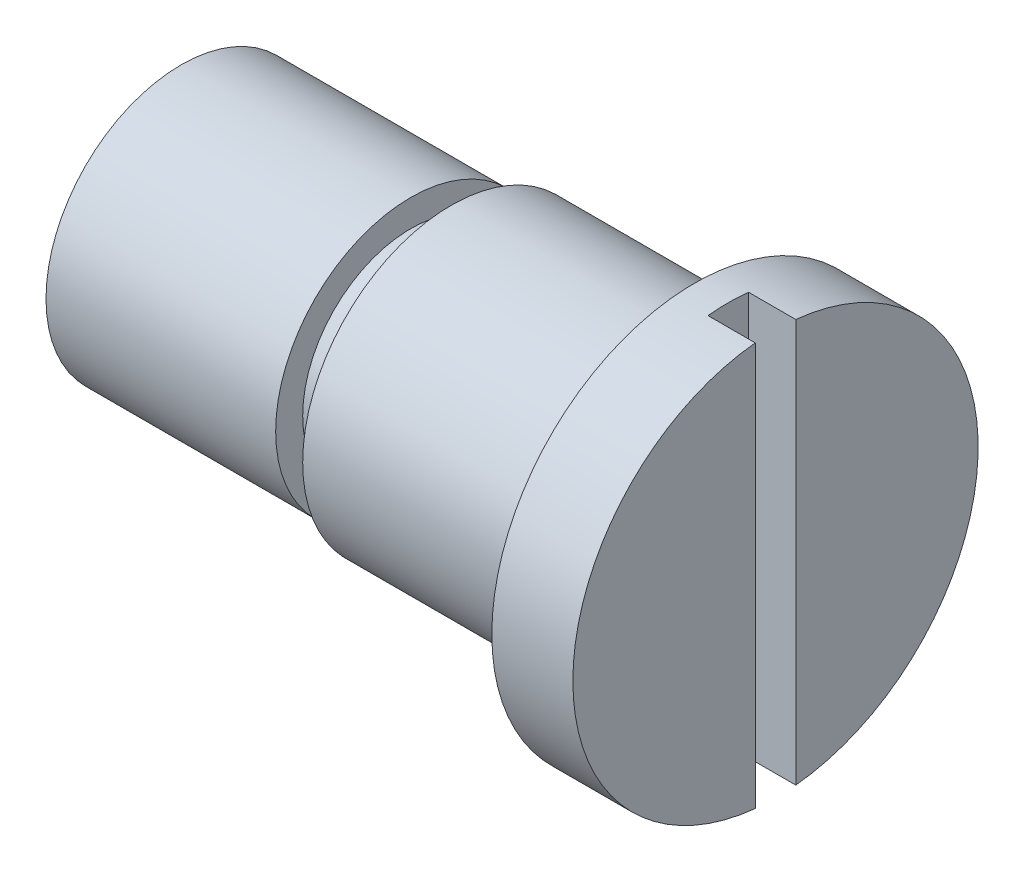
ISO-10303-21;
HEADER;
FILE_DESCRIPTION(('STEP AP214'),'2;1');
FILE_NAME('part.step','',(''),(''),'','','');
FILE_SCHEMA(('AUTOMOTIVE_DESIGN { 1 0 10303 214 1 1 1 1 }'));
ENDSEC;
DATA;
#1=APPLICATION_CONTEXT('core data for automotive mechanical design processes');
#2=APPLICATION_PROTOCOL_DEFINITION('international standard','automotive_design',2000,#1);
#3=PRODUCT_CONTEXT('',#1,'mechanical');
#4=PRODUCT('Part','Part','',(#3));
#5=PRODUCT_RELATED_PRODUCT_CATEGORY('part','',(#4));
#6=PRODUCT_DEFINITION_FORMATION('','',#4);
#7=PRODUCT_DEFINITION_CONTEXT('part definition',#1,'design');
#8=PRODUCT_DEFINITION('design','',#6,#7);
#9=PRODUCT_DEFINITION_SHAPE('','',#8);
#10=(LENGTH_UNIT() NAMED_UNIT(*) SI_UNIT(.MILLI.,.METRE.));
#11=(NAMED_UNIT(*) PLANE_ANGLE_UNIT() SI_UNIT($,.RADIAN.));
#12=(NAMED_UNIT(*) SI_UNIT($,.STERADIAN.) SOLID_ANGLE_UNIT());
#13=UNCERTAINTY_MEASURE_WITH_UNIT(LENGTH_MEASURE(1.E-05),#10,'distance_accuracy_value','');
#14=(GEOMETRIC_REPRESENTATION_CONTEXT(3) GLOBAL_UNCERTAINTY_ASSIGNED_CONTEXT((#13)) GLOBAL_UNIT_ASSIGNED_CONTEXT((#10,
#11,#12)) REPRESENTATION_CONTEXT('',''));
#15=CARTESIAN_POINT('',(0.,0.,0.));
#16=DIRECTION('',(0.,0.,1.));
#17=DIRECTION('',(1.,0.,0.));
#18=AXIS2_PLACEMENT_3D('',#15,#16,#17);
#19=CARTESIAN_POINT('',(44.,15.,0.));
#20=DIRECTION('',(-1.,0.,0.));
#21=DIRECTION('',(0.,0.,1.));
#22=AXIS2_PLACEMENT_3D('',#19,#20,#21);
#23=PLANE('',#22);
#24=CARTESIAN_POINT('',(44.,0.,0.));
#25=DIRECTION('',(-1.,0.,0.));
#26=DIRECTION('',(0.,0.,1.));
#27=AXIS2_PLACEMENT_3D('',#24,#25,#26);
#28=CIRCLE('',#27,15.);
#29=CARTESIAN_POINT('',(44.,14.9248115565993,-1.5));
#30=VERTEX_POINT('',#29);
#31=CARTESIAN_POINT('',(44.,-14.9248115565993,-1.5));
#32=VERTEX_POINT('',#31);
#33=EDGE_CURVE('E97',#30,#32,#28,.T.);
#34=ORIENTED_EDGE('',*,*,#33,.F.);
#35=DIRECTION('',(0.,-1.,0.));
#36=VECTOR('',#35,1.);
#37=CARTESIAN_POINT('',(44.,15.,-1.5));
#38=LINE('',#37,#36);
#39=EDGE_CURVE('E84',#30,#32,#38,.T.);
#40=ORIENTED_EDGE('',*,*,#39,.T.);
#41=EDGE_LOOP('',(#34,#40));
#42=FACE_BOUND('',#41,.T.);
#43=ADVANCED_FACE('F37',(#42),#23,.F.);
#44=CARTESIAN_POINT('',(0.,0.,0.));
#45=DIRECTION('',(1.,0.,0.));
#46=DIRECTION('',(0.,0.,-1.));
#47=AXIS2_PLACEMENT_3D('',#44,#45,#46);
#48=PLANE('',#47);
#49=CARTESIAN_POINT('',(0.,0.,0.));
#50=DIRECTION('',(-1.,0.,0.));
#51=DIRECTION('',(0.,0.,1.));
#52=AXIS2_PLACEMENT_3D('',#49,#50,#51);
#53=CIRCLE('',#52,10.);
#54=CARTESIAN_POINT('',(0.,0.,10.));
#55=VERTEX_POINT('',#54);
#56=EDGE_CURVE('E85',#55,#55,#53,.T.);
#57=ORIENTED_EDGE('',*,*,#56,.T.);
#58=EDGE_LOOP('',(#57));
#59=FACE_BOUND('',#58,.T.);
#60=ADVANCED_FACE('F39',(#59),#48,.F.);
#61=CARTESIAN_POINT('',(0.,0.,0.));
#62=DIRECTION('',(-1.,0.,0.));
#63=DIRECTION('',(0.,0.,1.));
#64=AXIS2_PLACEMENT_3D('',#61,#62,#63);
#65=CYLINDRICAL_SURFACE('',#64,10.);
#66=ORIENTED_EDGE('',*,*,#56,.F.);
#67=EDGE_LOOP('',(#66));
#68=FACE_BOUND('',#67,.T.);
#69=CARTESIAN_POINT('',(17.,0.,0.));
#70=DIRECTION('',(-1.,0.,0.));
#71=DIRECTION('',(0.,0.,1.));
#72=AXIS2_PLACEMENT_3D('',#69,#70,#71);
#73=CIRCLE('',#72,10.);
#74=CARTESIAN_POINT('',(17.,0.,10.));
#75=VERTEX_POINT('',#74);
#76=EDGE_CURVE('E119',#75,#75,#73,.T.);
#77=ORIENTED_EDGE('',*,*,#76,.T.);
#78=EDGE_LOOP('',(#77));
#79=FACE_BOUND('',#78,.T.);
#80=ADVANCED_FACE('F136',(#68,#79),#65,.T.);
#81=CARTESIAN_POINT('',(17.,10.,0.));
#82=DIRECTION('',(-1.,0.,0.));
#83=DIRECTION('',(0.,0.,1.));
#84=AXIS2_PLACEMENT_3D('',#81,#82,#83);
#85=PLANE('',#84);
#86=ORIENTED_EDGE('',*,*,#76,.F.);
#87=EDGE_LOOP('',(#86));
#88=FACE_BOUND('',#87,.T.);
#89=CARTESIAN_POINT('',(17.,0.,0.));
#90=DIRECTION('',(-1.,0.,0.));
#91=DIRECTION('',(0.,0.,1.));
#92=AXIS2_PLACEMENT_3D('',#89,#90,#91);
#93=CIRCLE('',#92,8.);
#94=CARTESIAN_POINT('',(17.,0.,8.));
#95=VERTEX_POINT('',#94);
#96=EDGE_CURVE('E116',#95,#95,#93,.T.);
#97=ORIENTED_EDGE('',*,*,#96,.T.);
#98=EDGE_LOOP('',(#97));
#99=FACE_BOUND('',#98,.T.);
#100=ADVANCED_FACE('F164',(#88,#99),#85,.F.);
#101=CARTESIAN_POINT('',(0.,0.,0.));
#102=DIRECTION('',(-1.,0.,0.));
#103=DIRECTION('',(0.,0.,1.));
#104=AXIS2_PLACEMENT_3D('',#101,#102,#103);
#105=CYLINDRICAL_SURFACE('',#104,8.);
#106=ORIENTED_EDGE('',*,*,#96,.F.);
#107=EDGE_LOOP('',(#106));
#108=FACE_BOUND('',#107,.T.);
#109=CARTESIAN_POINT('',(20.,0.,0.));
#110=DIRECTION('',(-1.,0.,0.));
#111=DIRECTION('',(0.,0.,1.));
#112=AXIS2_PLACEMENT_3D('',#109,#110,#111);
#113=CIRCLE('',#112,8.);
#114=CARTESIAN_POINT('',(20.,0.,8.));
#115=VERTEX_POINT('',#114);
#116=EDGE_CURVE('E113',#115,#115,#113,.T.);
#117=ORIENTED_EDGE('',*,*,#116,.T.);
#118=EDGE_LOOP('',(#117));
#119=FACE_BOUND('',#118,.T.);
#120=ADVANCED_FACE('F160',(#108,#119),#105,.T.);
#121=CARTESIAN_POINT('',(20.,8.,0.));
#122=DIRECTION('',(1.,0.,0.));
#123=DIRECTION('',(0.,0.,-1.));
#124=AXIS2_PLACEMENT_3D('',#121,#122,#123);
#125=PLANE('',#124);
#126=ORIENTED_EDGE('',*,*,#116,.F.);
#127=EDGE_LOOP('',(#126));
#128=FACE_BOUND('',#127,.T.);
#129=CARTESIAN_POINT('',(20.,0.,0.));
#130=DIRECTION('',(-1.,0.,0.));
#131=DIRECTION('',(0.,0.,1.));
#132=AXIS2_PLACEMENT_3D('',#129,#130,#131);
#133=CIRCLE('',#132,11.);
#134=CARTESIAN_POINT('',(20.,0.,11.));
#135=VERTEX_POINT('',#134);
#136=EDGE_CURVE('E110',#135,#135,#133,.T.);
#137=ORIENTED_EDGE('',*,*,#136,.T.);
#138=EDGE_LOOP('',(#137));
#139=FACE_BOUND('',#138,.T.);
#140=ADVANCED_FACE('F156',(#128,#139),#125,.F.);
#141=CARTESIAN_POINT('',(0.,0.,0.));
#142=DIRECTION('',(-1.,0.,0.));
#143=DIRECTION('',(0.,0.,1.));
#144=AXIS2_PLACEMENT_3D('',#141,#142,#143);
#145=CYLINDRICAL_SURFACE('',#144,11.);
#146=ORIENTED_EDGE('',*,*,#136,.F.);
#147=EDGE_LOOP('',(#146));
#148=FACE_BOUND('',#147,.T.);
#149=CARTESIAN_POINT('',(38.,0.,0.));
#150=DIRECTION('',(-1.,0.,0.));
#151=DIRECTION('',(0.,0.,1.));
#152=AXIS2_PLACEMENT_3D('',#149,#150,#151);
#153=CIRCLE('',#152,11.);
#154=CARTESIAN_POINT('',(38.,0.,11.));
#155=VERTEX_POINT('',#154);
#156=EDGE_CURVE('E107',#155,#155,#153,.T.);
#157=ORIENTED_EDGE('',*,*,#156,.T.);
#158=EDGE_LOOP('',(#157));
#159=FACE_BOUND('',#158,.T.);
#160=ADVANCED_FACE('F150',(#148,#159),#145,.T.);
#161=CARTESIAN_POINT('',(38.,11.,0.));
#162=DIRECTION('',(1.,0.,0.));
#163=DIRECTION('',(0.,0.,-1.));
#164=AXIS2_PLACEMENT_3D('',#161,#162,#163);
#165=PLANE('',#164);
#166=ORIENTED_EDGE('',*,*,#156,.F.);
#167=EDGE_LOOP('',(#166));
#168=FACE_BOUND('',#167,.T.);
#169=CARTESIAN_POINT('',(38.,0.,0.));
#170=DIRECTION('',(-1.,0.,0.));
#171=DIRECTION('',(0.,0.,1.));
#172=AXIS2_PLACEMENT_3D('',#169,#170,#171);
#173=CIRCLE('',#172,15.);
#174=CARTESIAN_POINT('',(38.,0.,15.));
#175=VERTEX_POINT('',#174);
#176=EDGE_CURVE('E101',#175,#175,#173,.T.);
#177=ORIENTED_EDGE('',*,*,#176,.T.);
#178=EDGE_LOOP('',(#177));
#179=FACE_BOUND('',#178,.T.);
#180=ADVANCED_FACE('F146',(#168,#179),#165,.F.);
#181=CARTESIAN_POINT('',(0.,0.,0.));
#182=DIRECTION('',(-1.,0.,0.));
#183=DIRECTION('',(0.,0.,1.));
#184=AXIS2_PLACEMENT_3D('',#181,#182,#183);
#185=CYLINDRICAL_SURFACE('',#184,15.);
#186=CARTESIAN_POINT('',(40.5,0.,0.));
#187=DIRECTION('',(1.,0.,0.));
#188=DIRECTION('',(0.,0.,-1.));
#189=AXIS2_PLACEMENT_3D('',#186,#187,#188);
#190=CIRCLE('',#189,15.);
#191=CARTESIAN_POINT('',(40.5,14.9248115565993,-1.5));
#192=VERTEX_POINT('',#191);
#193=CARTESIAN_POINT('',(40.5,14.9248115565993,1.5));
#194=VERTEX_POINT('',#193);
#195=EDGE_CURVE('E11',#192,#194,#190,.T.);
#196=ORIENTED_EDGE('',*,*,#195,.F.);
#197=DIRECTION('',(-1.,0.,0.));
#198=VECTOR('',#197,1.);
#199=CARTESIAN_POINT('',(0.,14.9248115565993,-1.5));
#200=LINE('',#199,#198);
#201=EDGE_CURVE('E60',#192,#30,#200,.F.);
#202=ORIENTED_EDGE('',*,*,#201,.T.);
#203=ORIENTED_EDGE('',*,*,#33,.T.);
#204=DIRECTION('',(-1.,0.,0.));
#205=VECTOR('',#204,1.);
#206=CARTESIAN_POINT('',(0.,-14.9248115565993,-1.5));
#207=LINE('',#206,#205);
#208=CARTESIAN_POINT('',(40.5,-14.9248115565993,-1.5));
#209=VERTEX_POINT('',#208);
#210=EDGE_CURVE('E98',#32,#209,#207,.T.);
#211=ORIENTED_EDGE('',*,*,#210,.T.);
#212=CARTESIAN_POINT('',(40.5,-14.9248115565993,1.5));
#213=VERTEX_POINT('',#212);
#214=EDGE_CURVE('E41',#213,#209,#190,.T.);
#215=ORIENTED_EDGE('',*,*,#214,.F.);
#216=DIRECTION('',(-1.,0.,0.));
#217=VECTOR('',#216,1.);
#218=CARTESIAN_POINT('',(0.,-14.9248115565993,1.5));
#219=LINE('',#218,#217);
#220=CARTESIAN_POINT('',(44.,-14.9248115565993,1.5));
#221=VERTEX_POINT('',#220);
#222=EDGE_CURVE('E79',#213,#221,#219,.F.);
#223=ORIENTED_EDGE('',*,*,#222,.T.);
#224=CARTESIAN_POINT('',(44.,14.9248115565993,1.5));
#225=VERTEX_POINT('',#224);
#226=EDGE_CURVE('E92',#221,#225,#28,.T.);
#227=ORIENTED_EDGE('',*,*,#226,.T.);
#228=DIRECTION('',(-1.,0.,0.));
#229=VECTOR('',#228,1.);
#230=CARTESIAN_POINT('',(0.,14.9248115565993,1.5));
#231=LINE('',#230,#229);
#232=EDGE_CURVE('E52',#225,#194,#231,.T.);
#233=ORIENTED_EDGE('',*,*,#232,.T.);
#234=EDGE_LOOP('',(#196,#202,#203,#211,#215,#223,#227,#233));
#235=FACE_BOUND('',#234,.T.);
#236=ORIENTED_EDGE('',*,*,#176,.F.);
#237=EDGE_LOOP('',(#236));
#238=FACE_BOUND('',#237,.T.);
#239=ADVANCED_FACE('F90',(#235,#238),#185,.T.);
#240=ORIENTED_EDGE('',*,*,#226,.F.);
#241=DIRECTION('',(0.,1.,0.));
#242=VECTOR('',#241,1.);
#243=CARTESIAN_POINT('',(44.,15.,1.5));
#244=LINE('',#243,#242);
#245=EDGE_CURVE('E76',#221,#225,#244,.T.);
#246=ORIENTED_EDGE('',*,*,#245,.T.);
#247=EDGE_LOOP('',(#240,#246));
#248=FACE_BOUND('',#247,.T.);
#249=ADVANCED_FACE('F96',(#248),#23,.F.);
#250=CARTESIAN_POINT('',(40.5,0.,0.));
#251=DIRECTION('',(1.,0.,0.));
#252=DIRECTION('',(0.,0.,-1.));
#253=AXIS2_PLACEMENT_3D('',#250,#251,#252);
#254=PLANE('',#253);
#255=ORIENTED_EDGE('',*,*,#195,.T.);
#256=DIRECTION('',(0.,-1.,0.));
#257=VECTOR('',#256,1.);
#258=CARTESIAN_POINT('',(40.5,16.9984793997671,1.5));
#259=LINE('',#258,#257);
#260=EDGE_CURVE('E94',#194,#213,#259,.T.);
#261=ORIENTED_EDGE('',*,*,#260,.T.);
#262=ORIENTED_EDGE('',*,*,#214,.T.);
#263=DIRECTION('',(0.,1.,0.));
#264=VECTOR('',#263,1.);
#265=CARTESIAN_POINT('',(40.5,16.9984793997671,-1.5));
#266=LINE('',#265,#264);
#267=EDGE_CURVE('E128',#209,#192,#266,.T.);
#268=ORIENTED_EDGE('',*,*,#267,.T.);
#269=EDGE_LOOP('',(#255,#261,#262,#268));
#270=FACE_BOUND('',#269,.T.);
#271=ADVANCED_FACE('F127',(#270),#254,.T.);
#272=CARTESIAN_POINT('',(40.5,16.9984793997671,-1.5));
#273=DIRECTION('',(0.,0.,-1.));
#274=DIRECTION('',(-1.,0.,0.));
#275=AXIS2_PLACEMENT_3D('',#272,#273,#274);
#276=PLANE('',#275);
#277=ORIENTED_EDGE('',*,*,#39,.F.);
#278=ORIENTED_EDGE('',*,*,#201,.F.);
#279=ORIENTED_EDGE('',*,*,#267,.F.);
#280=ORIENTED_EDGE('',*,*,#210,.F.);
#281=EDGE_LOOP('',(#277,#278,#279,#280));
#282=FACE_BOUND('',#281,.T.);
#283=ADVANCED_FACE('F129',(#282),#276,.F.);
#284=CARTESIAN_POINT('',(40.5,16.9984793997671,1.5));
#285=DIRECTION('',(0.,0.,1.));
#286=DIRECTION('',(1.,0.,0.));
#287=AXIS2_PLACEMENT_3D('',#284,#285,#286);
#288=PLANE('',#287);
#289=ORIENTED_EDGE('',*,*,#245,.F.);
#290=ORIENTED_EDGE('',*,*,#222,.F.);
#291=ORIENTED_EDGE('',*,*,#260,.F.);
#292=ORIENTED_EDGE('',*,*,#232,.F.);
#293=EDGE_LOOP('',(#289,#290,#291,#292));
#294=FACE_BOUND('',#293,.T.);
#295=ADVANCED_FACE('F78',(#294),#288,.F.);
#296=CLOSED_SHELL('',(#43,#60,#80,#100,#120,#140,#160,#180,#239,#249,#271,#283,#295));
#297=MANIFOLD_SOLID_BREP('B2',#296);
#298=ADVANCED_BREP_SHAPE_REPRESENTATION('',(#18,#297),#14);
#299=SHAPE_DEFINITION_REPRESENTATION(#9,#298);
ENDSEC;
END-ISO-10303-21;
